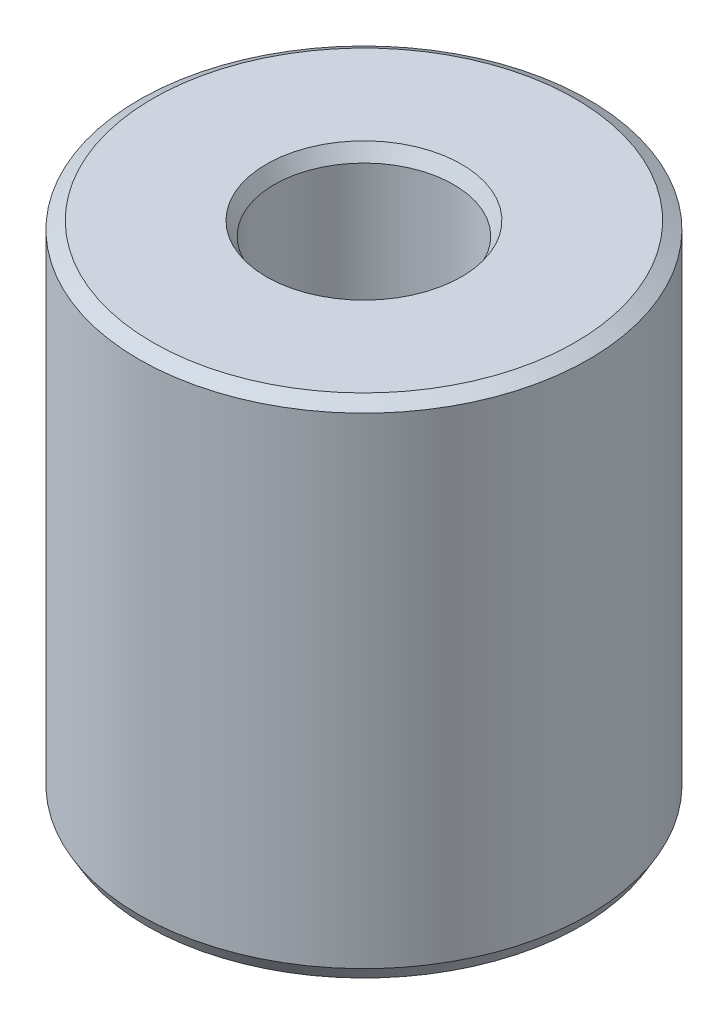
ISO-10303-21;
HEADER;
FILE_DESCRIPTION(('STEP AP214'),'2;1');
FILE_NAME('part.step','',(''),(''),'','','');
FILE_SCHEMA(('AUTOMOTIVE_DESIGN { 1 0 10303 214 1 1 1 1 }'));
ENDSEC;
DATA;
#1=APPLICATION_CONTEXT('core data for automotive mechanical design processes');
#2=APPLICATION_PROTOCOL_DEFINITION('international standard','automotive_design',2000,#1);
#3=PRODUCT_CONTEXT('',#1,'mechanical');
#4=PRODUCT('Part','Part','',(#3));
#5=PRODUCT_RELATED_PRODUCT_CATEGORY('part','',(#4));
#6=PRODUCT_DEFINITION_FORMATION('','',#4);
#7=PRODUCT_DEFINITION_CONTEXT('part definition',#1,'design');
#8=PRODUCT_DEFINITION('design','',#6,#7);
#9=PRODUCT_DEFINITION_SHAPE('','',#8);
#10=(LENGTH_UNIT() NAMED_UNIT(*) SI_UNIT(.MILLI.,.METRE.));
#11=(NAMED_UNIT(*) PLANE_ANGLE_UNIT() SI_UNIT($,.RADIAN.));
#12=(NAMED_UNIT(*) SI_UNIT($,.STERADIAN.) SOLID_ANGLE_UNIT());
#13=UNCERTAINTY_MEASURE_WITH_UNIT(LENGTH_MEASURE(1.E-05),#10,'distance_accuracy_value','');
#14=(GEOMETRIC_REPRESENTATION_CONTEXT(3) GLOBAL_UNCERTAINTY_ASSIGNED_CONTEXT((#13)) GLOBAL_UNIT_ASSIGNED_CONTEXT((#10,
#11,#12)) REPRESENTATION_CONTEXT('',''));
#15=CARTESIAN_POINT('',(0.,0.,0.));
#16=DIRECTION('',(0.,0.,1.));
#17=DIRECTION('',(1.,0.,0.));
#18=AXIS2_PLACEMENT_3D('',#15,#16,#17);
#19=CARTESIAN_POINT('',(0.,128.516499360946,0.));
#20=DIRECTION('',(0.,-1.,0.));
#21=DIRECTION('',(0.,0.,-1.));
#22=AXIS2_PLACEMENT_3D('',#19,#20,#21);
#23=CYLINDRICAL_SURFACE('',#22,57.5);
#24=CARTESIAN_POINT('',(0.,3.49230149855695,0.));
#25=DIRECTION('',(0.,1.,0.));
#26=DIRECTION('',(0.,0.,1.));
#27=AXIS2_PLACEMENT_3D('',#24,#25,#26);
#28=CIRCLE('',#27,57.5);
#29=CARTESIAN_POINT('',(0.,3.49230149855695,57.5));
#30=VERTEX_POINT('',#29);
#31=EDGE_CURVE('E10',#30,#30,#28,.T.);
#32=ORIENTED_EDGE('',*,*,#31,.T.);
#33=EDGE_LOOP('',(#32));
#34=FACE_BOUND('',#33,.T.);
#35=CARTESIAN_POINT('',(0.,126.500218150663,0.));
#36=DIRECTION('',(0.,1.,0.));
#37=DIRECTION('',(0.,0.,1.));
#38=AXIS2_PLACEMENT_3D('',#35,#36,#37);
#39=CIRCLE('',#38,57.5);
#40=CARTESIAN_POINT('',(0.,126.500218150663,57.5));
#41=VERTEX_POINT('',#40);
#42=EDGE_CURVE('E50',#41,#41,#39,.F.);
#43=ORIENTED_EDGE('',*,*,#42,.T.);
#44=EDGE_LOOP('',(#43));
#45=FACE_BOUND('',#44,.T.);
#46=ADVANCED_FACE('F39',(#34,#45),#23,.T.);
#47=CARTESIAN_POINT('',(0.,128.516499360946,0.));
#48=DIRECTION('',(0.,1.,0.));
#49=DIRECTION('',(0.,0.,1.));
#50=AXIS2_PLACEMENT_3D('',#47,#48,#49);
#51=PLANE('',#50);
#52=CARTESIAN_POINT('',(0.,128.516499360946,0.));
#53=DIRECTION('',(0.,1.,0.));
#54=DIRECTION('',(0.,0.,1.));
#55=AXIS2_PLACEMENT_3D('',#52,#53,#54);
#56=CIRCLE('',#55,24.9497953884385);
#57=CARTESIAN_POINT('',(0.,128.516499360946,24.9497953884385));
#58=VERTEX_POINT('',#57);
#59=EDGE_CURVE('E58',#58,#58,#56,.F.);
#60=ORIENTED_EDGE('',*,*,#59,.T.);
#61=EDGE_LOOP('',(#60));
#62=FACE_BOUND('',#61,.T.);
#63=CARTESIAN_POINT('',(0.,128.516499360946,0.));
#64=DIRECTION('',(0.,1.,0.));
#65=DIRECTION('',(0.,0.,1.));
#66=AXIS2_PLACEMENT_3D('',#63,#64,#65);
#67=CIRCLE('',#66,54.0076985014431);
#68=CARTESIAN_POINT('',(0.,128.516499360946,54.0076985014431));
#69=VERTEX_POINT('',#68);
#70=EDGE_CURVE('E61',#69,#69,#67,.T.);
#71=ORIENTED_EDGE('',*,*,#70,.T.);
#72=EDGE_LOOP('',(#71));
#73=FACE_BOUND('',#72,.T.);
#74=ADVANCED_FACE('F88',(#62,#73),#51,.T.);
#75=CARTESIAN_POINT('',(0.,0.,0.));
#76=DIRECTION('',(0.,1.,0.));
#77=DIRECTION('',(0.,0.,1.));
#78=AXIS2_PLACEMENT_3D('',#75,#76,#77);
#79=PLANE('',#78);
#80=CARTESIAN_POINT('',(0.,0.,0.));
#81=DIRECTION('',(0.,1.,0.));
#82=DIRECTION('',(0.,0.,1.));
#83=AXIS2_PLACEMENT_3D('',#80,#81,#82);
#84=CIRCLE('',#83,26.4258156767123);
#85=CARTESIAN_POINT('',(0.,0.,26.4258156767123));
#86=VERTEX_POINT('',#85);
#87=EDGE_CURVE('E51',#86,#86,#84,.T.);
#88=ORIENTED_EDGE('',*,*,#87,.T.);
#89=EDGE_LOOP('',(#88));
#90=FACE_BOUND('',#89,.T.);
#91=CARTESIAN_POINT('',(0.,0.,0.));
#92=DIRECTION('',(0.,1.,0.));
#93=DIRECTION('',(0.,0.,1.));
#94=AXIS2_PLACEMENT_3D('',#91,#92,#93);
#95=CIRCLE('',#94,55.4837187897168);
#96=CARTESIAN_POINT('',(0.,0.,55.4837187897168));
#97=VERTEX_POINT('',#96);
#98=EDGE_CURVE('E54',#97,#97,#95,.F.);
#99=ORIENTED_EDGE('',*,*,#98,.T.);
#100=EDGE_LOOP('',(#99));
#101=FACE_BOUND('',#100,.T.);
#102=ADVANCED_FACE('F83',(#90,#101),#79,.F.);
#103=CARTESIAN_POINT('',(0.,128.516499360946,0.));
#104=DIRECTION('',(0.,-1.,0.));
#105=DIRECTION('',(0.,0.,-1.));
#106=AXIS2_PLACEMENT_3D('',#103,#104,#105);
#107=CYLINDRICAL_SURFACE('',#106,22.9335141781554);
#108=CARTESIAN_POINT('',(0.,125.024197862389,0.));
#109=DIRECTION('',(0.,1.,0.));
#110=DIRECTION('',(0.,0.,1.));
#111=AXIS2_PLACEMENT_3D('',#108,#109,#110);
#112=CIRCLE('',#111,22.9335141781554);
#113=CARTESIAN_POINT('',(0.,125.024197862389,22.9335141781554));
#114=VERTEX_POINT('',#113);
#115=EDGE_CURVE('E67',#114,#114,#112,.T.);
#116=ORIENTED_EDGE('',*,*,#115,.T.);
#117=EDGE_LOOP('',(#116));
#118=FACE_BOUND('',#117,.T.);
#119=CARTESIAN_POINT('',(0.,2.01628121028322,0.));
#120=DIRECTION('',(0.,1.,0.));
#121=DIRECTION('',(0.,0.,1.));
#122=AXIS2_PLACEMENT_3D('',#119,#120,#121);
#123=CIRCLE('',#122,22.9335141781554);
#124=CARTESIAN_POINT('',(0.,2.01628121028322,22.9335141781554));
#125=VERTEX_POINT('',#124);
#126=EDGE_CURVE('E69',#125,#125,#123,.F.);
#127=ORIENTED_EDGE('',*,*,#126,.T.);
#128=EDGE_LOOP('',(#127));
#129=FACE_BOUND('',#128,.T.);
#130=ADVANCED_FACE('F71',(#118,#129),#107,.F.);
#131=CARTESIAN_POINT('',(0.,125.024197862389,0.));
#132=DIRECTION('',(0.,1.,0.));
#133=DIRECTION('',(0.,0.,1.));
#134=AXIS2_PLACEMENT_3D('',#131,#132,#133);
#135=CONICAL_SURFACE('',#134,22.9335141781554,0.523598775598294);
#136=ORIENTED_EDGE('',*,*,#59,.F.);
#137=EDGE_LOOP('',(#136));
#138=FACE_BOUND('',#137,.T.);
#139=ORIENTED_EDGE('',*,*,#115,.F.);
#140=EDGE_LOOP('',(#139));
#141=FACE_BOUND('',#140,.T.);
#142=ADVANCED_FACE('F77',(#138,#141),#135,.F.);
#143=CARTESIAN_POINT('',(0.,0.,0.));
#144=DIRECTION('',(0.,-1.,0.));
#145=DIRECTION('',(0.,0.,-1.));
#146=AXIS2_PLACEMENT_3D('',#143,#144,#145);
#147=CONICAL_SURFACE('',#146,26.4258156767123,1.04719755119659);
#148=ORIENTED_EDGE('',*,*,#126,.F.);
#149=EDGE_LOOP('',(#148));
#150=FACE_BOUND('',#149,.T.);
#151=ORIENTED_EDGE('',*,*,#87,.F.);
#152=EDGE_LOOP('',(#151));
#153=FACE_BOUND('',#152,.T.);
#154=ADVANCED_FACE('F73',(#150,#153),#147,.F.);
#155=CARTESIAN_POINT('',(0.,3.49230149855695,0.));
#156=DIRECTION('',(0.,1.,0.));
#157=DIRECTION('',(0.,0.,1.));
#158=AXIS2_PLACEMENT_3D('',#155,#156,#157);
#159=CONICAL_SURFACE('',#158,57.5,0.523598775598302);
#160=ORIENTED_EDGE('',*,*,#98,.F.);
#161=EDGE_LOOP('',(#160));
#162=FACE_BOUND('',#161,.T.);
#163=ORIENTED_EDGE('',*,*,#31,.F.);
#164=EDGE_LOOP('',(#163));
#165=FACE_BOUND('',#164,.T.);
#166=ADVANCED_FACE('F76',(#162,#165),#159,.T.);
#167=CARTESIAN_POINT('',(0.,128.516499360946,0.));
#168=DIRECTION('',(0.,-1.,0.));
#169=DIRECTION('',(0.,0.,-1.));
#170=AXIS2_PLACEMENT_3D('',#167,#168,#169);
#171=CONICAL_SURFACE('',#170,54.0076985014431,1.0471975511966);
#172=ORIENTED_EDGE('',*,*,#42,.F.);
#173=EDGE_LOOP('',(#172));
#174=FACE_BOUND('',#173,.T.);
#175=ORIENTED_EDGE('',*,*,#70,.F.);
#176=EDGE_LOOP('',(#175));
#177=FACE_BOUND('',#176,.T.);
#178=ADVANCED_FACE('F45',(#174,#177),#171,.T.);
#179=CLOSED_SHELL('',(#46,#74,#102,#130,#142,#154,#166,#178));
#180=MANIFOLD_SOLID_BREP('B2',#179);
#181=ADVANCED_BREP_SHAPE_REPRESENTATION('',(#18,#180),#14);
#182=SHAPE_DEFINITION_REPRESENTATION(#9,#181);
ENDSEC;
END-ISO-10303-21;
